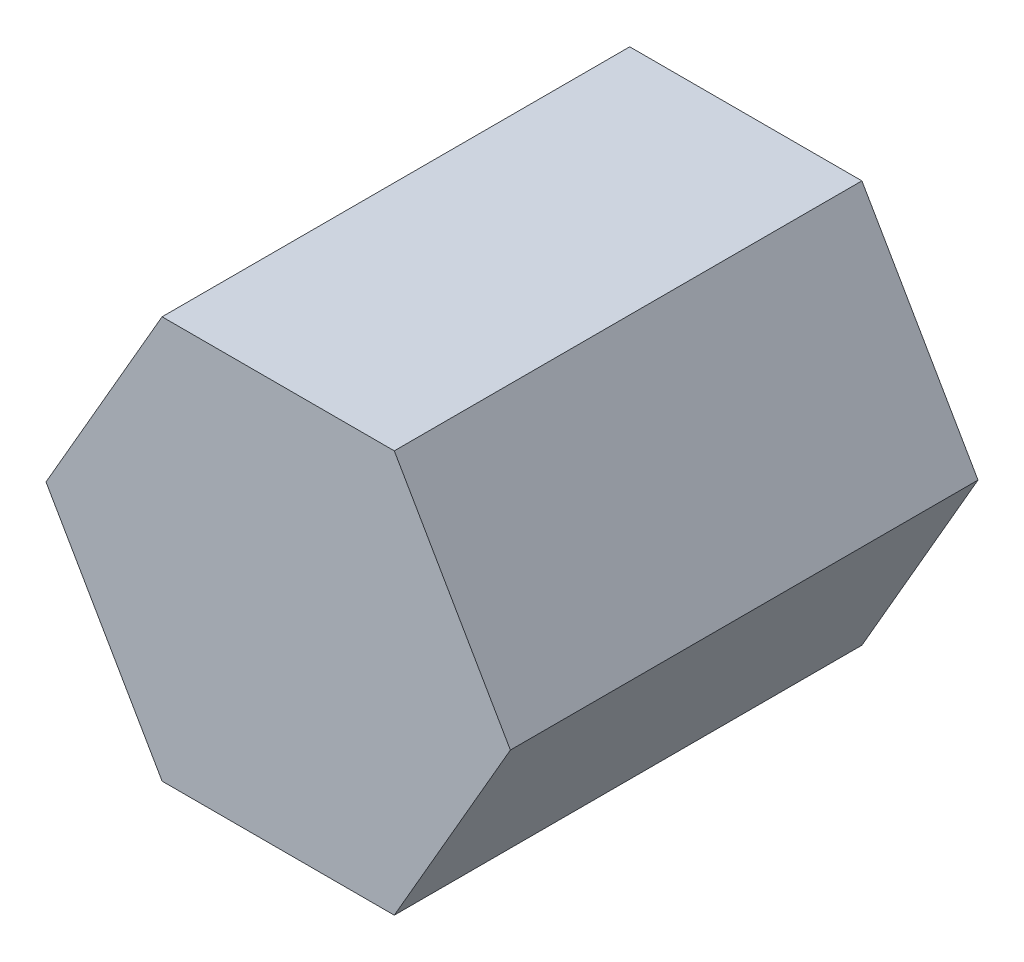
ISO-10303-21;
HEADER;
FILE_DESCRIPTION(('STEP AP214'),'2;1');
FILE_NAME('part.step','',(''),(''),'','','');
FILE_SCHEMA(('AUTOMOTIVE_DESIGN { 1 0 10303 214 1 1 1 1 }'));
ENDSEC;
DATA;
#1=APPLICATION_CONTEXT('core data for automotive mechanical design processes');
#2=APPLICATION_PROTOCOL_DEFINITION('international standard','automotive_design',2000,#1);
#3=PRODUCT_CONTEXT('',#1,'mechanical');
#4=PRODUCT('Part','Part','',(#3));
#5=PRODUCT_RELATED_PRODUCT_CATEGORY('part','',(#4));
#6=PRODUCT_DEFINITION_FORMATION('','',#4);
#7=PRODUCT_DEFINITION_CONTEXT('part definition',#1,'design');
#8=PRODUCT_DEFINITION('design','',#6,#7);
#9=PRODUCT_DEFINITION_SHAPE('','',#8);
#10=(LENGTH_UNIT() NAMED_UNIT(*) SI_UNIT(.MILLI.,.METRE.));
#11=(NAMED_UNIT(*) PLANE_ANGLE_UNIT() SI_UNIT($,.RADIAN.));
#12=(NAMED_UNIT(*) SI_UNIT($,.STERADIAN.) SOLID_ANGLE_UNIT());
#13=UNCERTAINTY_MEASURE_WITH_UNIT(LENGTH_MEASURE(1.E-05),#10,'distance_accuracy_value','');
#14=(GEOMETRIC_REPRESENTATION_CONTEXT(3) GLOBAL_UNCERTAINTY_ASSIGNED_CONTEXT((#13)) GLOBAL_UNIT_ASSIGNED_CONTEXT((#10,
#11,#12)) REPRESENTATION_CONTEXT('',''));
#15=CARTESIAN_POINT('',(0.,0.,0.));
#16=DIRECTION('',(0.,0.,1.));
#17=DIRECTION('',(1.,0.,0.));
#18=AXIS2_PLACEMENT_3D('',#15,#16,#17);
#19=CARTESIAN_POINT('',(-3.59641797389176,-5.76995486987261,12.7));
#20=DIRECTION('',(0.86602540378444,-0.499999999999998,0.));
#21=DIRECTION('',(0.499999999999998,0.86602540378444,0.));
#22=AXIS2_PLACEMENT_3D('',#19,#20,#21);
#23=PLANE('',#22);
#24=DIRECTION('',(-0.499999999999998,-0.86602540378444,0.));
#25=VECTOR('',#24,1.);
#26=CARTESIAN_POINT('',(-3.59641797389176,-5.76995486987261,0.));
#27=LINE('',#26,#25);
#28=CARTESIAN_POINT('',(-0.443508153847222,-0.308954869872601,0.));
#29=VERTEX_POINT('',#28);
#30=CARTESIAN_POINT('',(-3.59641797389176,-5.76995486987261,0.));
#31=VERTEX_POINT('',#30);
#32=EDGE_CURVE('E119',#29,#31,#27,.T.);
#33=ORIENTED_EDGE('',*,*,#32,.T.);
#34=DIRECTION('',(0.,0.,-1.));
#35=VECTOR('',#34,1.);
#36=CARTESIAN_POINT('',(-3.59641797389176,-5.76995486987261,12.7));
#37=LINE('',#36,#35);
#38=CARTESIAN_POINT('',(-3.59641797389176,-5.76995486987261,12.7));
#39=VERTEX_POINT('',#38);
#40=EDGE_CURVE('E11',#39,#31,#37,.T.);
#41=ORIENTED_EDGE('',*,*,#40,.F.);
#42=DIRECTION('',(-0.499999999999998,-0.86602540378444,0.));
#43=VECTOR('',#42,1.);
#44=CARTESIAN_POINT('',(-3.59641797389176,-5.76995486987261,12.7));
#45=LINE('',#44,#43);
#46=CARTESIAN_POINT('',(-0.443508153847222,-0.308954869872601,12.7));
#47=VERTEX_POINT('',#46);
#48=EDGE_CURVE('E129',#47,#39,#45,.T.);
#49=ORIENTED_EDGE('',*,*,#48,.F.);
#50=DIRECTION('',(0.,0.,-1.));
#51=VECTOR('',#50,1.);
#52=CARTESIAN_POINT('',(-0.443508153847222,-0.308954869872601,12.7));
#53=LINE('',#52,#51);
#54=EDGE_CURVE('E115',#47,#29,#53,.T.);
#55=ORIENTED_EDGE('',*,*,#54,.T.);
#56=EDGE_LOOP('',(#33,#41,#49,#55));
#57=FACE_BOUND('',#56,.T.);
#58=ADVANCED_FACE('F35',(#57),#23,.F.);
#59=CARTESIAN_POINT('',(-0.44350815384718,-11.2309548698726,12.7));
#60=DIRECTION('',(0.866025403784436,0.500000000000004,0.));
#61=DIRECTION('',(-0.500000000000004,0.866025403784436,0.));
#62=AXIS2_PLACEMENT_3D('',#59,#60,#61);
#63=PLANE('',#62);
#64=DIRECTION('',(0.500000000000005,-0.866025403784436,0.));
#65=VECTOR('',#64,1.);
#66=CARTESIAN_POINT('',(-0.44350815384718,-11.2309548698726,0.));
#67=LINE('',#66,#65);
#68=CARTESIAN_POINT('',(-0.44350815384718,-11.2309548698726,0.));
#69=VERTEX_POINT('',#68);
#70=EDGE_CURVE('E122',#31,#69,#67,.T.);
#71=ORIENTED_EDGE('',*,*,#70,.T.);
#72=DIRECTION('',(0.,0.,-1.));
#73=VECTOR('',#72,1.);
#74=CARTESIAN_POINT('',(-0.44350815384718,-11.2309548698726,12.7));
#75=LINE('',#74,#73);
#76=CARTESIAN_POINT('',(-0.44350815384718,-11.2309548698726,12.7));
#77=VERTEX_POINT('',#76);
#78=EDGE_CURVE('E43',#77,#69,#75,.T.);
#79=ORIENTED_EDGE('',*,*,#78,.F.);
#80=DIRECTION('',(0.500000000000005,-0.866025403784436,0.));
#81=VECTOR('',#80,1.);
#82=CARTESIAN_POINT('',(-0.44350815384718,-11.2309548698726,12.7));
#83=LINE('',#82,#81);
#84=EDGE_CURVE('E88',#39,#77,#83,.T.);
#85=ORIENTED_EDGE('',*,*,#84,.F.);
#86=ORIENTED_EDGE('',*,*,#40,.T.);
#87=EDGE_LOOP('',(#71,#79,#85,#86));
#88=FACE_BOUND('',#87,.T.);
#89=ADVANCED_FACE('F153',(#88),#63,.F.);
#90=CARTESIAN_POINT('',(5.86231148624191,-11.2309548698726,12.7));
#91=DIRECTION('',(0.,1.,0.));
#92=DIRECTION('',(0.,0.,1.));
#93=AXIS2_PLACEMENT_3D('',#90,#91,#92);
#94=PLANE('',#93);
#95=DIRECTION('',(1.,0.,0.));
#96=VECTOR('',#95,1.);
#97=CARTESIAN_POINT('',(5.86231148624191,-11.2309548698726,0.));
#98=LINE('',#97,#96);
#99=CARTESIAN_POINT('',(5.86231148624191,-11.2309548698726,0.));
#100=VERTEX_POINT('',#99);
#101=EDGE_CURVE('E124',#69,#100,#98,.T.);
#102=ORIENTED_EDGE('',*,*,#101,.T.);
#103=DIRECTION('',(0.,0.,-1.));
#104=VECTOR('',#103,1.);
#105=CARTESIAN_POINT('',(5.86231148624191,-11.2309548698726,12.7));
#106=LINE('',#105,#104);
#107=CARTESIAN_POINT('',(5.86231148624191,-11.2309548698726,12.7));
#108=VERTEX_POINT('',#107);
#109=EDGE_CURVE('E110',#108,#100,#106,.T.);
#110=ORIENTED_EDGE('',*,*,#109,.F.);
#111=DIRECTION('',(1.,0.,0.));
#112=VECTOR('',#111,1.);
#113=CARTESIAN_POINT('',(5.86231148624191,-11.2309548698726,12.7));
#114=LINE('',#113,#112);
#115=EDGE_CURVE('E101',#77,#108,#114,.T.);
#116=ORIENTED_EDGE('',*,*,#115,.F.);
#117=ORIENTED_EDGE('',*,*,#78,.T.);
#118=EDGE_LOOP('',(#102,#110,#116,#117));
#119=FACE_BOUND('',#118,.T.);
#120=ADVANCED_FACE('F135',(#119),#94,.F.);
#121=CARTESIAN_POINT('',(9.01522130628645,-5.76995486987259,12.7));
#122=DIRECTION('',(-0.86602540378444,0.499999999999998,0.));
#123=DIRECTION('',(-0.499999999999998,-0.86602540378444,0.));
#124=AXIS2_PLACEMENT_3D('',#121,#122,#123);
#125=PLANE('',#124);
#126=DIRECTION('',(0.499999999999998,0.86602540378444,0.));
#127=VECTOR('',#126,1.);
#128=CARTESIAN_POINT('',(9.01522130628645,-5.76995486987259,0.));
#129=LINE('',#128,#127);
#130=CARTESIAN_POINT('',(9.01522130628645,-5.76995486987259,0.));
#131=VERTEX_POINT('',#130);
#132=EDGE_CURVE('E109',#100,#131,#129,.T.);
#133=ORIENTED_EDGE('',*,*,#132,.T.);
#134=DIRECTION('',(0.,0.,-1.));
#135=VECTOR('',#134,1.);
#136=CARTESIAN_POINT('',(9.01522130628645,-5.76995486987259,12.7));
#137=LINE('',#136,#135);
#138=CARTESIAN_POINT('',(9.01522130628645,-5.76995486987259,12.7));
#139=VERTEX_POINT('',#138);
#140=EDGE_CURVE('E106',#139,#131,#137,.T.);
#141=ORIENTED_EDGE('',*,*,#140,.F.);
#142=DIRECTION('',(0.499999999999998,0.86602540378444,0.));
#143=VECTOR('',#142,1.);
#144=CARTESIAN_POINT('',(9.01522130628645,-5.76995486987259,12.7));
#145=LINE('',#144,#143);
#146=EDGE_CURVE('E95',#108,#139,#145,.T.);
#147=ORIENTED_EDGE('',*,*,#146,.F.);
#148=ORIENTED_EDGE('',*,*,#109,.T.);
#149=EDGE_LOOP('',(#133,#141,#147,#148));
#150=FACE_BOUND('',#149,.T.);
#151=ADVANCED_FACE('F107',(#150),#125,.F.);
#152=CARTESIAN_POINT('',(5.86231148624188,-0.308954869872601,12.7));
#153=DIRECTION('',(-0.866025403784436,-0.500000000000004,0.));
#154=DIRECTION('',(0.500000000000004,-0.866025403784436,0.));
#155=AXIS2_PLACEMENT_3D('',#152,#153,#154);
#156=PLANE('',#155);
#157=DIRECTION('',(-0.500000000000004,0.866025403784436,0.));
#158=VECTOR('',#157,1.);
#159=CARTESIAN_POINT('',(5.86231148624188,-0.308954869872601,0.));
#160=LINE('',#159,#158);
#161=CARTESIAN_POINT('',(5.86231148624188,-0.308954869872601,0.));
#162=VERTEX_POINT('',#161);
#163=EDGE_CURVE('E74',#131,#162,#160,.T.);
#164=ORIENTED_EDGE('',*,*,#163,.T.);
#165=DIRECTION('',(0.,0.,-1.));
#166=VECTOR('',#165,1.);
#167=CARTESIAN_POINT('',(5.86231148624188,-0.308954869872601,12.7));
#168=LINE('',#167,#166);
#169=CARTESIAN_POINT('',(5.86231148624188,-0.308954869872601,12.7));
#170=VERTEX_POINT('',#169);
#171=EDGE_CURVE('E111',#170,#162,#168,.T.);
#172=ORIENTED_EDGE('',*,*,#171,.F.);
#173=DIRECTION('',(-0.500000000000004,0.866025403784436,0.));
#174=VECTOR('',#173,1.);
#175=CARTESIAN_POINT('',(5.86231148624188,-0.308954869872601,12.7));
#176=LINE('',#175,#174);
#177=EDGE_CURVE('E99',#139,#170,#176,.T.);
#178=ORIENTED_EDGE('',*,*,#177,.F.);
#179=ORIENTED_EDGE('',*,*,#140,.T.);
#180=EDGE_LOOP('',(#164,#172,#178,#179));
#181=FACE_BOUND('',#180,.T.);
#182=ADVANCED_FACE('F113',(#181),#156,.F.);
#183=CARTESIAN_POINT('',(-0.443508153847222,-0.308954869872601,12.7));
#184=DIRECTION('',(0.,-1.,0.));
#185=DIRECTION('',(0.,0.,-1.));
#186=AXIS2_PLACEMENT_3D('',#183,#184,#185);
#187=PLANE('',#186);
#188=DIRECTION('',(-1.,0.,0.));
#189=VECTOR('',#188,1.);
#190=CARTESIAN_POINT('',(-0.443508153847222,-0.308954869872601,0.));
#191=LINE('',#190,#189);
#192=EDGE_CURVE('E80',#162,#29,#191,.T.);
#193=ORIENTED_EDGE('',*,*,#192,.T.);
#194=ORIENTED_EDGE('',*,*,#54,.F.);
#195=DIRECTION('',(-1.,0.,0.));
#196=VECTOR('',#195,1.);
#197=CARTESIAN_POINT('',(-0.443508153847222,-0.308954869872601,12.7));
#198=LINE('',#197,#196);
#199=EDGE_CURVE('E51',#170,#47,#198,.T.);
#200=ORIENTED_EDGE('',*,*,#199,.F.);
#201=ORIENTED_EDGE('',*,*,#171,.T.);
#202=EDGE_LOOP('',(#193,#194,#200,#201));
#203=FACE_BOUND('',#202,.T.);
#204=ADVANCED_FACE('F142',(#203),#187,.F.);
#205=CARTESIAN_POINT('',(0.,0.,12.7));
#206=DIRECTION('',(0.,0.,-1.));
#207=DIRECTION('',(-1.,0.,0.));
#208=AXIS2_PLACEMENT_3D('',#205,#206,#207);
#209=PLANE('',#208);
#210=ORIENTED_EDGE('',*,*,#48,.T.);
#211=ORIENTED_EDGE('',*,*,#84,.T.);
#212=ORIENTED_EDGE('',*,*,#115,.T.);
#213=ORIENTED_EDGE('',*,*,#146,.T.);
#214=ORIENTED_EDGE('',*,*,#177,.T.);
#215=ORIENTED_EDGE('',*,*,#199,.T.);
#216=EDGE_LOOP('',(#210,#211,#212,#213,#214,#215));
#217=FACE_BOUND('',#216,.T.);
#218=ADVANCED_FACE('F97',(#217),#209,.F.);
#219=CARTESIAN_POINT('',(0.,0.,0.));
#220=DIRECTION('',(0.,0.,-1.));
#221=DIRECTION('',(-1.,0.,0.));
#222=AXIS2_PLACEMENT_3D('',#219,#220,#221);
#223=PLANE('',#222);
#224=ORIENTED_EDGE('',*,*,#32,.F.);
#225=ORIENTED_EDGE('',*,*,#192,.F.);
#226=ORIENTED_EDGE('',*,*,#163,.F.);
#227=ORIENTED_EDGE('',*,*,#132,.F.);
#228=ORIENTED_EDGE('',*,*,#101,.F.);
#229=ORIENTED_EDGE('',*,*,#70,.F.);
#230=EDGE_LOOP('',(#224,#225,#226,#227,#228,#229));
#231=FACE_BOUND('',#230,.T.);
#232=ADVANCED_FACE('F138',(#231),#223,.T.);
#233=CLOSED_SHELL('',(#58,#89,#120,#151,#182,#204,#218,#232));
#234=MANIFOLD_SOLID_BREP('B2',#233);
#235=ADVANCED_BREP_SHAPE_REPRESENTATION('',(#18,#234),#14);
#236=SHAPE_DEFINITION_REPRESENTATION(#9,#235);
ENDSEC;
END-ISO-10303-21;
